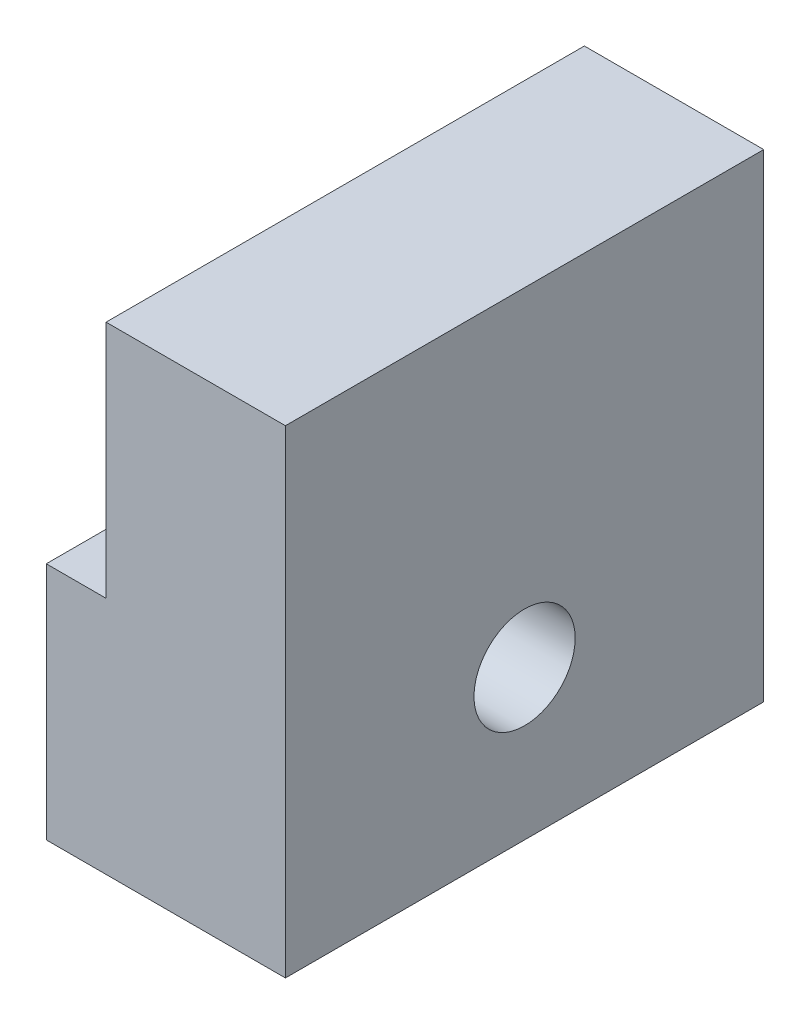
ISO-10303-21;
HEADER;
FILE_DESCRIPTION(('STEP AP214'),'2;1');
FILE_NAME('part.step','',(''),(''),'','','');
FILE_SCHEMA(('AUTOMOTIVE_DESIGN { 1 0 10303 214 1 1 1 1 }'));
ENDSEC;
DATA;
#1=APPLICATION_CONTEXT('core data for automotive mechanical design processes');
#2=APPLICATION_PROTOCOL_DEFINITION('international standard','automotive_design',2000,#1);
#3=PRODUCT_CONTEXT('',#1,'mechanical');
#4=PRODUCT('Part','Part','',(#3));
#5=PRODUCT_RELATED_PRODUCT_CATEGORY('part','',(#4));
#6=PRODUCT_DEFINITION_FORMATION('','',#4);
#7=PRODUCT_DEFINITION_CONTEXT('part definition',#1,'design');
#8=PRODUCT_DEFINITION('design','',#6,#7);
#9=PRODUCT_DEFINITION_SHAPE('','',#8);
#10=(LENGTH_UNIT() NAMED_UNIT(*) SI_UNIT(.MILLI.,.METRE.));
#11=(NAMED_UNIT(*) PLANE_ANGLE_UNIT() SI_UNIT($,.RADIAN.));
#12=(NAMED_UNIT(*) SI_UNIT($,.STERADIAN.) SOLID_ANGLE_UNIT());
#13=UNCERTAINTY_MEASURE_WITH_UNIT(LENGTH_MEASURE(1.E-05),#10,'distance_accuracy_value','');
#14=(GEOMETRIC_REPRESENTATION_CONTEXT(3) GLOBAL_UNCERTAINTY_ASSIGNED_CONTEXT((#13)) GLOBAL_UNIT_ASSIGNED_CONTEXT((#10,
#11,#12)) REPRESENTATION_CONTEXT('',''));
#15=CARTESIAN_POINT('',(0.,0.,0.));
#16=DIRECTION('',(0.,0.,1.));
#17=DIRECTION('',(1.,0.,0.));
#18=AXIS2_PLACEMENT_3D('',#15,#16,#17);
#19=CARTESIAN_POINT('',(25.4,25.4,25.4));
#20=DIRECTION('',(0.,-1.,0.));
#21=DIRECTION('',(0.,0.,-1.));
#22=AXIS2_PLACEMENT_3D('',#19,#20,#21);
#23=PLANE('',#22);
#24=DIRECTION('',(0.,0.,-1.));
#25=VECTOR('',#24,1.);
#26=CARTESIAN_POINT('',(6.35,25.4,-25.4));
#27=LINE('',#26,#25);
#28=CARTESIAN_POINT('',(6.35,25.4,25.4));
#29=VERTEX_POINT('',#28);
#30=CARTESIAN_POINT('',(6.35,25.4,-25.4));
#31=VERTEX_POINT('',#30);
#32=EDGE_CURVE('E108',#29,#31,#27,.T.);
#33=ORIENTED_EDGE('',*,*,#32,.F.);
#34=DIRECTION('',(-1.,0.,0.));
#35=VECTOR('',#34,1.);
#36=CARTESIAN_POINT('',(25.4,25.4,25.4));
#37=LINE('',#36,#35);
#38=CARTESIAN_POINT('',(25.4,25.4,25.4));
#39=VERTEX_POINT('',#38);
#40=EDGE_CURVE('E43',#39,#29,#37,.T.);
#41=ORIENTED_EDGE('',*,*,#40,.F.);
#42=DIRECTION('',(0.,0.,1.));
#43=VECTOR('',#42,1.);
#44=CARTESIAN_POINT('',(25.4,25.4,25.4));
#45=LINE('',#44,#43);
#46=CARTESIAN_POINT('',(25.4,25.4,-25.4));
#47=VERTEX_POINT('',#46);
#48=EDGE_CURVE('E81',#47,#39,#45,.T.);
#49=ORIENTED_EDGE('',*,*,#48,.F.);
#50=DIRECTION('',(-1.,0.,0.));
#51=VECTOR('',#50,1.);
#52=CARTESIAN_POINT('',(25.4,25.4,-25.4));
#53=LINE('',#52,#51);
#54=EDGE_CURVE('E11',#47,#31,#53,.T.);
#55=ORIENTED_EDGE('',*,*,#54,.T.);
#56=EDGE_LOOP('',(#33,#41,#49,#55));
#57=FACE_BOUND('',#56,.T.);
#58=ADVANCED_FACE('F35',(#57),#23,.F.);
#59=CARTESIAN_POINT('',(25.4,0.,0.));
#60=DIRECTION('',(-1.,0.,0.));
#61=DIRECTION('',(0.,0.,1.));
#62=AXIS2_PLACEMENT_3D('',#59,#60,#61);
#63=PLANE('',#62);
#64=DIRECTION('',(0.,1.,0.));
#65=VECTOR('',#64,1.);
#66=CARTESIAN_POINT('',(25.4,-25.4,-25.4));
#67=LINE('',#66,#65);
#68=CARTESIAN_POINT('',(25.4,-25.4,-25.4));
#69=VERTEX_POINT('',#68);
#70=EDGE_CURVE('E127',#69,#47,#67,.T.);
#71=ORIENTED_EDGE('',*,*,#70,.T.);
#72=ORIENTED_EDGE('',*,*,#48,.T.);
#73=DIRECTION('',(0.,-1.,0.));
#74=VECTOR('',#73,1.);
#75=CARTESIAN_POINT('',(25.4,-25.4,25.4));
#76=LINE('',#75,#74);
#77=CARTESIAN_POINT('',(25.4,-25.4,25.4));
#78=VERTEX_POINT('',#77);
#79=EDGE_CURVE('E130',#39,#78,#76,.T.);
#80=ORIENTED_EDGE('',*,*,#79,.T.);
#81=DIRECTION('',(0.,0.,-1.));
#82=VECTOR('',#81,1.);
#83=CARTESIAN_POINT('',(25.4,-25.4,25.4));
#84=LINE('',#83,#82);
#85=EDGE_CURVE('E59',#78,#69,#84,.T.);
#86=ORIENTED_EDGE('',*,*,#85,.T.);
#87=EDGE_LOOP('',(#71,#72,#80,#86));
#88=FACE_BOUND('',#87,.T.);
#89=CARTESIAN_POINT('',(25.4,-9.525,0.));
#90=DIRECTION('',(1.,0.,0.));
#91=DIRECTION('',(0.,0.,-1.));
#92=AXIS2_PLACEMENT_3D('',#89,#90,#91);
#93=CIRCLE('',#92,5.3721);
#94=CARTESIAN_POINT('',(25.4,-9.525,-5.3721));
#95=VERTEX_POINT('',#94);
#96=EDGE_CURVE('E122',#95,#95,#93,.T.);
#97=ORIENTED_EDGE('',*,*,#96,.F.);
#98=EDGE_LOOP('',(#97));
#99=FACE_BOUND('',#98,.T.);
#100=ADVANCED_FACE('F146',(#88,#99),#63,.F.);
#101=CARTESIAN_POINT('',(0.,0.,0.));
#102=DIRECTION('',(-1.,0.,0.));
#103=DIRECTION('',(0.,0.,1.));
#104=AXIS2_PLACEMENT_3D('',#101,#102,#103);
#105=PLANE('',#104);
#106=DIRECTION('',(0.,0.,1.));
#107=VECTOR('',#106,1.);
#108=CARTESIAN_POINT('',(0.,0.,-25.4));
#109=LINE('',#108,#107);
#110=CARTESIAN_POINT('',(0.,0.,-25.4));
#111=VERTEX_POINT('',#110);
#112=CARTESIAN_POINT('',(0.,0.,25.4));
#113=VERTEX_POINT('',#112);
#114=EDGE_CURVE('E111',#111,#113,#109,.T.);
#115=ORIENTED_EDGE('',*,*,#114,.F.);
#116=DIRECTION('',(0.,1.,0.));
#117=VECTOR('',#116,1.);
#118=CARTESIAN_POINT('',(0.,-25.4,-25.4));
#119=LINE('',#118,#117);
#120=CARTESIAN_POINT('',(0.,-25.4,-25.4));
#121=VERTEX_POINT('',#120);
#122=EDGE_CURVE('E115',#121,#111,#119,.T.);
#123=ORIENTED_EDGE('',*,*,#122,.F.);
#124=DIRECTION('',(0.,0.,-1.));
#125=VECTOR('',#124,1.);
#126=CARTESIAN_POINT('',(0.,-25.4,25.4));
#127=LINE('',#126,#125);
#128=CARTESIAN_POINT('',(0.,-25.4,25.4));
#129=VERTEX_POINT('',#128);
#130=EDGE_CURVE('E74',#129,#121,#127,.T.);
#131=ORIENTED_EDGE('',*,*,#130,.F.);
#132=DIRECTION('',(0.,-1.,0.));
#133=VECTOR('',#132,1.);
#134=CARTESIAN_POINT('',(0.,-25.4,25.4));
#135=LINE('',#134,#133);
#136=EDGE_CURVE('E135',#113,#129,#135,.T.);
#137=ORIENTED_EDGE('',*,*,#136,.F.);
#138=EDGE_LOOP('',(#115,#123,#131,#137));
#139=FACE_BOUND('',#138,.T.);
#140=CARTESIAN_POINT('',(0.,-9.525,0.));
#141=DIRECTION('',(1.,0.,0.));
#142=DIRECTION('',(0.,0.,-1.));
#143=AXIS2_PLACEMENT_3D('',#140,#141,#142);
#144=CIRCLE('',#143,5.3721);
#145=CARTESIAN_POINT('',(0.,-9.525,-5.3721));
#146=VERTEX_POINT('',#145);
#147=EDGE_CURVE('E117',#146,#146,#144,.T.);
#148=ORIENTED_EDGE('',*,*,#147,.T.);
#149=EDGE_LOOP('',(#148));
#150=FACE_BOUND('',#149,.T.);
#151=ADVANCED_FACE('F165',(#139,#150),#105,.T.);
#152=CARTESIAN_POINT('',(25.4,-25.4,-25.4));
#153=DIRECTION('',(0.,0.,1.));
#154=DIRECTION('',(1.,0.,0.));
#155=AXIS2_PLACEMENT_3D('',#152,#153,#154);
#156=PLANE('',#155);
#157=ORIENTED_EDGE('',*,*,#122,.T.);
#158=DIRECTION('',(-1.,0.,0.));
#159=VECTOR('',#158,1.);
#160=CARTESIAN_POINT('',(6.35,0.,-25.4));
#161=LINE('',#160,#159);
#162=CARTESIAN_POINT('',(6.35,0.,-25.4));
#163=VERTEX_POINT('',#162);
#164=EDGE_CURVE('E97',#163,#111,#161,.T.);
#165=ORIENTED_EDGE('',*,*,#164,.F.);
#166=DIRECTION('',(0.,-1.,0.));
#167=VECTOR('',#166,1.);
#168=CARTESIAN_POINT('',(6.35,25.4,-25.4));
#169=LINE('',#168,#167);
#170=EDGE_CURVE('E103',#31,#163,#169,.T.);
#171=ORIENTED_EDGE('',*,*,#170,.F.);
#172=ORIENTED_EDGE('',*,*,#54,.F.);
#173=ORIENTED_EDGE('',*,*,#70,.F.);
#174=DIRECTION('',(-1.,0.,0.));
#175=VECTOR('',#174,1.);
#176=CARTESIAN_POINT('',(25.4,-25.4,-25.4));
#177=LINE('',#176,#175);
#178=EDGE_CURVE('E133',#69,#121,#177,.T.);
#179=ORIENTED_EDGE('',*,*,#178,.T.);
#180=EDGE_LOOP('',(#157,#165,#171,#172,#173,#179));
#181=FACE_BOUND('',#180,.T.);
#182=ADVANCED_FACE('F37',(#181),#156,.F.);
#183=CARTESIAN_POINT('',(25.4,-25.4,25.4));
#184=DIRECTION('',(0.,0.,-1.));
#185=DIRECTION('',(-1.,0.,0.));
#186=AXIS2_PLACEMENT_3D('',#183,#184,#185);
#187=PLANE('',#186);
#188=DIRECTION('',(0.,1.,0.));
#189=VECTOR('',#188,1.);
#190=CARTESIAN_POINT('',(6.35,25.4,25.4));
#191=LINE('',#190,#189);
#192=CARTESIAN_POINT('',(6.35,0.,25.4));
#193=VERTEX_POINT('',#192);
#194=EDGE_CURVE('E102',#193,#29,#191,.T.);
#195=ORIENTED_EDGE('',*,*,#194,.F.);
#196=DIRECTION('',(-1.,0.,0.));
#197=VECTOR('',#196,1.);
#198=CARTESIAN_POINT('',(6.35,0.,25.4));
#199=LINE('',#198,#197);
#200=EDGE_CURVE('E100',#193,#113,#199,.T.);
#201=ORIENTED_EDGE('',*,*,#200,.T.);
#202=ORIENTED_EDGE('',*,*,#136,.T.);
#203=DIRECTION('',(-1.,0.,0.));
#204=VECTOR('',#203,1.);
#205=CARTESIAN_POINT('',(25.4,-25.4,25.4));
#206=LINE('',#205,#204);
#207=EDGE_CURVE('E139',#78,#129,#206,.T.);
#208=ORIENTED_EDGE('',*,*,#207,.F.);
#209=ORIENTED_EDGE('',*,*,#79,.F.);
#210=ORIENTED_EDGE('',*,*,#40,.T.);
#211=EDGE_LOOP('',(#195,#201,#202,#208,#209,#210));
#212=FACE_BOUND('',#211,.T.);
#213=ADVANCED_FACE('F143',(#212),#187,.F.);
#214=CARTESIAN_POINT('',(25.4,-25.4,25.4));
#215=DIRECTION('',(0.,1.,0.));
#216=DIRECTION('',(0.,0.,1.));
#217=AXIS2_PLACEMENT_3D('',#214,#215,#216);
#218=PLANE('',#217);
#219=ORIENTED_EDGE('',*,*,#130,.T.);
#220=ORIENTED_EDGE('',*,*,#178,.F.);
#221=ORIENTED_EDGE('',*,*,#85,.F.);
#222=ORIENTED_EDGE('',*,*,#207,.T.);
#223=EDGE_LOOP('',(#219,#220,#221,#222));
#224=FACE_BOUND('',#223,.T.);
#225=ADVANCED_FACE('F149',(#224),#218,.F.);
#226=CARTESIAN_POINT('',(25.4,-9.525,0.));
#227=DIRECTION('',(-1.,0.,0.));
#228=DIRECTION('',(0.,0.,1.));
#229=AXIS2_PLACEMENT_3D('',#226,#227,#228);
#230=CYLINDRICAL_SURFACE('',#229,5.3721);
#231=ORIENTED_EDGE('',*,*,#96,.T.);
#232=EDGE_LOOP('',(#231));
#233=FACE_BOUND('',#232,.T.);
#234=ORIENTED_EDGE('',*,*,#147,.F.);
#235=EDGE_LOOP('',(#234));
#236=FACE_BOUND('',#235,.T.);
#237=ADVANCED_FACE('F151',(#233,#236),#230,.F.);
#238=CARTESIAN_POINT('',(6.35,0.,-25.4));
#239=DIRECTION('',(0.,-1.,0.));
#240=DIRECTION('',(0.,0.,-1.));
#241=AXIS2_PLACEMENT_3D('',#238,#239,#240);
#242=PLANE('',#241);
#243=ORIENTED_EDGE('',*,*,#114,.T.);
#244=ORIENTED_EDGE('',*,*,#200,.F.);
#245=DIRECTION('',(0.,0.,1.));
#246=VECTOR('',#245,1.);
#247=CARTESIAN_POINT('',(6.35,0.,-25.4));
#248=LINE('',#247,#246);
#249=EDGE_CURVE('E50',#163,#193,#248,.T.);
#250=ORIENTED_EDGE('',*,*,#249,.F.);
#251=ORIENTED_EDGE('',*,*,#164,.T.);
#252=EDGE_LOOP('',(#243,#244,#250,#251));
#253=FACE_BOUND('',#252,.T.);
#254=ADVANCED_FACE('F95',(#253),#242,.F.);
#255=CARTESIAN_POINT('',(6.35,0.,0.));
#256=DIRECTION('',(-1.,0.,0.));
#257=DIRECTION('',(0.,0.,1.));
#258=AXIS2_PLACEMENT_3D('',#255,#256,#257);
#259=PLANE('',#258);
#260=CARTESIAN_POINT('',(6.35,12.7,0.));
#261=DIRECTION('',(-1.,0.,0.));
#262=DIRECTION('',(0.,0.,1.));
#263=AXIS2_PLACEMENT_3D('',#260,#261,#262);
#264=CIRCLE('',#263,4.7625);
#265=CARTESIAN_POINT('',(6.35,12.7,4.76250000000001));
#266=VERTEX_POINT('',#265);
#267=EDGE_CURVE('E189',#266,#266,#264,.T.);
#268=ORIENTED_EDGE('',*,*,#267,.F.);
#269=EDGE_LOOP('',(#268));
#270=FACE_BOUND('',#269,.T.);
#271=ORIENTED_EDGE('',*,*,#170,.T.);
#272=ORIENTED_EDGE('',*,*,#249,.T.);
#273=ORIENTED_EDGE('',*,*,#194,.T.);
#274=ORIENTED_EDGE('',*,*,#32,.T.);
#275=EDGE_LOOP('',(#271,#272,#273,#274));
#276=FACE_BOUND('',#275,.T.);
#277=ADVANCED_FACE('F106',(#270,#276),#259,.T.);
#278=CARTESIAN_POINT('',(19.05,12.7,0.));
#279=DIRECTION('',(-1.,0.,0.));
#280=DIRECTION('',(0.,0.,1.));
#281=AXIS2_PLACEMENT_3D('',#278,#279,#280);
#282=CYLINDRICAL_SURFACE('',#281,4.7625);
#283=CARTESIAN_POINT('',(19.05,12.7,0.));
#284=DIRECTION('',(-1.,0.,0.));
#285=DIRECTION('',(0.,0.,1.));
#286=AXIS2_PLACEMENT_3D('',#283,#284,#285);
#287=CIRCLE('',#286,4.7625);
#288=CARTESIAN_POINT('',(19.05,12.7,4.76250000000001));
#289=VERTEX_POINT('',#288);
#290=EDGE_CURVE('E188',#289,#289,#287,.T.);
#291=ORIENTED_EDGE('',*,*,#290,.F.);
#292=EDGE_LOOP('',(#291));
#293=FACE_BOUND('',#292,.T.);
#294=ORIENTED_EDGE('',*,*,#267,.T.);
#295=EDGE_LOOP('',(#294));
#296=FACE_BOUND('',#295,.T.);
#297=ADVANCED_FACE('F176',(#293,#296),#282,.F.);
#298=CARTESIAN_POINT('',(19.05,12.7,0.));
#299=DIRECTION('',(-1.,0.,0.));
#300=DIRECTION('',(0.,0.,1.));
#301=AXIS2_PLACEMENT_3D('',#298,#299,#300);
#302=PLANE('',#301);
#303=ORIENTED_EDGE('',*,*,#290,.T.);
#304=EDGE_LOOP('',(#303));
#305=FACE_BOUND('',#304,.T.);
#306=ADVANCED_FACE('F180',(#305),#302,.T.);
#307=CLOSED_SHELL('',(#58,#100,#151,#182,#213,#225,#237,#254,#277,#297,#306));
#308=MANIFOLD_SOLID_BREP('B2',#307);
#309=ADVANCED_BREP_SHAPE_REPRESENTATION('',(#18,#308),#14);
#310=SHAPE_DEFINITION_REPRESENTATION(#9,#309);
ENDSEC;
END-ISO-10303-21;
